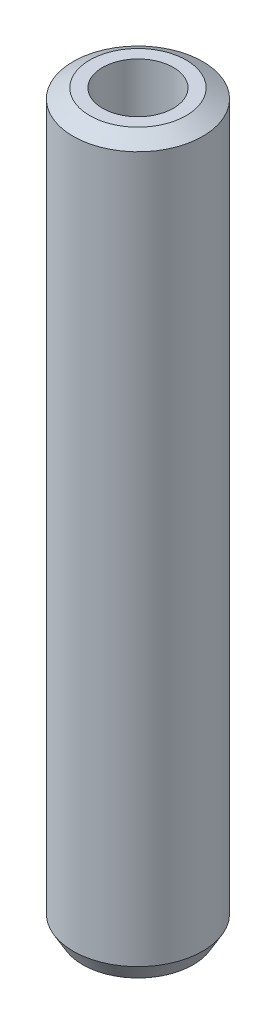
ISO-10303-21;
HEADER;
FILE_DESCRIPTION(('STEP AP214'),'2;1');
FILE_NAME('part.step','',(''),(''),'','','');
FILE_SCHEMA(('AUTOMOTIVE_DESIGN { 1 0 10303 214 1 1 1 1 }'));
ENDSEC;
DATA;
#1=APPLICATION_CONTEXT('core data for automotive mechanical design processes');
#2=APPLICATION_PROTOCOL_DEFINITION('international standard','automotive_design',2000,#1);
#3=PRODUCT_CONTEXT('',#1,'mechanical');
#4=PRODUCT('Part','Part','',(#3));
#5=PRODUCT_RELATED_PRODUCT_CATEGORY('part','',(#4));
#6=PRODUCT_DEFINITION_FORMATION('','',#4);
#7=PRODUCT_DEFINITION_CONTEXT('part definition',#1,'design');
#8=PRODUCT_DEFINITION('design','',#6,#7);
#9=PRODUCT_DEFINITION_SHAPE('','',#8);
#10=(LENGTH_UNIT() NAMED_UNIT(*) SI_UNIT(.MILLI.,.METRE.));
#11=(NAMED_UNIT(*) PLANE_ANGLE_UNIT() SI_UNIT($,.RADIAN.));
#12=(NAMED_UNIT(*) SI_UNIT($,.STERADIAN.) SOLID_ANGLE_UNIT());
#13=UNCERTAINTY_MEASURE_WITH_UNIT(LENGTH_MEASURE(1.E-05),#10,'distance_accuracy_value','');
#14=(GEOMETRIC_REPRESENTATION_CONTEXT(3) GLOBAL_UNCERTAINTY_ASSIGNED_CONTEXT((#13)) GLOBAL_UNIT_ASSIGNED_CONTEXT((#10,
#11,#12)) REPRESENTATION_CONTEXT('',''));
#15=CARTESIAN_POINT('',(0.,0.,0.));
#16=DIRECTION('',(0.,0.,1.));
#17=DIRECTION('',(1.,0.,0.));
#18=AXIS2_PLACEMENT_3D('',#15,#16,#17);
#19=CARTESIAN_POINT('',(0.,254.082430996546,0.));
#20=DIRECTION('',(0.,-1.,0.));
#21=DIRECTION('',(0.,0.,-1.));
#22=AXIS2_PLACEMENT_3D('',#19,#20,#21);
#23=CYLINDRICAL_SURFACE('',#22,22.5);
#24=CARTESIAN_POINT('',(0.,250.754810845848,0.));
#25=DIRECTION('',(0.,1.,0.));
#26=DIRECTION('',(0.,0.,1.));
#27=AXIS2_PLACEMENT_3D('',#24,#25,#26);
#28=CIRCLE('',#27,22.5);
#29=CARTESIAN_POINT('',(0.,250.754810845848,22.5));
#30=VERTEX_POINT('',#29);
#31=EDGE_CURVE('E50',#30,#30,#28,.F.);
#32=ORIENTED_EDGE('',*,*,#31,.T.);
#33=EDGE_LOOP('',(#32));
#34=FACE_BOUND('',#33,.T.);
#35=CARTESIAN_POINT('',(0.,5.76360716929813,0.));
#36=DIRECTION('',(0.,1.,0.));
#37=DIRECTION('',(0.,0.,1.));
#38=AXIS2_PLACEMENT_3D('',#35,#36,#37);
#39=CIRCLE('',#38,22.5);
#40=CARTESIAN_POINT('',(0.,5.76360716929813,22.5));
#41=VERTEX_POINT('',#40);
#42=EDGE_CURVE('E51',#41,#41,#39,.T.);
#43=ORIENTED_EDGE('',*,*,#42,.T.);
#44=EDGE_LOOP('',(#43));
#45=FACE_BOUND('',#44,.T.);
#46=ADVANCED_FACE('F39',(#34,#45),#23,.T.);
#47=CARTESIAN_POINT('',(0.,254.082430996546,0.));
#48=DIRECTION('',(0.,1.,0.));
#49=DIRECTION('',(0.,0.,1.));
#50=AXIS2_PLACEMENT_3D('',#47,#48,#49);
#51=PLANE('',#50);
#52=CARTESIAN_POINT('',(0.,254.082430996546,0.));
#53=DIRECTION('',(0.,1.,0.));
#54=DIRECTION('',(0.,0.,1.));
#55=AXIS2_PLACEMENT_3D('',#52,#53,#54);
#56=CIRCLE('',#55,16.7363928307019);
#57=CARTESIAN_POINT('',(0.,254.082430996546,16.7363928307019));
#58=VERTEX_POINT('',#57);
#59=EDGE_CURVE('E54',#58,#58,#56,.T.);
#60=ORIENTED_EDGE('',*,*,#59,.T.);
#61=EDGE_LOOP('',(#60));
#62=FACE_BOUND('',#61,.T.);
#63=CARTESIAN_POINT('',(0.,254.082430996546,0.));
#64=DIRECTION('',(0.,1.,0.));
#65=DIRECTION('',(0.,0.,1.));
#66=AXIS2_PLACEMENT_3D('',#63,#64,#65);
#67=CIRCLE('',#66,12.2979417798204);
#68=CARTESIAN_POINT('',(0.,254.082430996546,12.2979417798204));
#69=VERTEX_POINT('',#68);
#70=EDGE_CURVE('E58',#69,#69,#67,.T.);
#71=ORIENTED_EDGE('',*,*,#70,.F.);
#72=EDGE_LOOP('',(#71));
#73=FACE_BOUND('',#72,.T.);
#74=ADVANCED_FACE('F69',(#62,#73),#51,.T.);
#75=CARTESIAN_POINT('',(0.,0.,0.));
#76=DIRECTION('',(0.,1.,0.));
#77=DIRECTION('',(0.,0.,1.));
#78=AXIS2_PLACEMENT_3D('',#75,#76,#77);
#79=PLANE('',#78);
#80=CARTESIAN_POINT('',(0.,0.,0.));
#81=DIRECTION('',(0.,1.,0.));
#82=DIRECTION('',(0.,0.,1.));
#83=AXIS2_PLACEMENT_3D('',#80,#81,#82);
#84=CIRCLE('',#83,19.1723798493024);
#85=CARTESIAN_POINT('',(0.,0.,19.1723798493024));
#86=VERTEX_POINT('',#85);
#87=EDGE_CURVE('E10',#86,#86,#84,.F.);
#88=ORIENTED_EDGE('',*,*,#87,.T.);
#89=EDGE_LOOP('',(#88));
#90=FACE_BOUND('',#89,.T.);
#91=CARTESIAN_POINT('',(0.,0.,0.));
#92=DIRECTION('',(0.,1.,0.));
#93=DIRECTION('',(0.,0.,1.));
#94=AXIS2_PLACEMENT_3D('',#91,#92,#93);
#95=CIRCLE('',#94,12.2979417798204);
#96=CARTESIAN_POINT('',(0.,0.,12.2979417798204));
#97=VERTEX_POINT('',#96);
#98=EDGE_CURVE('E63',#97,#97,#95,.T.);
#99=ORIENTED_EDGE('',*,*,#98,.T.);
#100=EDGE_LOOP('',(#99));
#101=FACE_BOUND('',#100,.T.);
#102=ADVANCED_FACE('F75',(#90,#101),#79,.F.);
#103=CARTESIAN_POINT('',(0.,254.082430996546,0.));
#104=DIRECTION('',(0.,-1.,0.));
#105=DIRECTION('',(0.,0.,-1.));
#106=AXIS2_PLACEMENT_3D('',#103,#104,#105);
#107=CYLINDRICAL_SURFACE('',#106,12.2979417798204);
#108=ORIENTED_EDGE('',*,*,#70,.T.);
#109=EDGE_LOOP('',(#108));
#110=FACE_BOUND('',#109,.T.);
#111=ORIENTED_EDGE('',*,*,#98,.F.);
#112=EDGE_LOOP('',(#111));
#113=FACE_BOUND('',#112,.T.);
#114=ADVANCED_FACE('F70',(#110,#113),#107,.F.);
#115=CARTESIAN_POINT('',(0.,254.082430996546,0.));
#116=DIRECTION('',(0.,-1.,0.));
#117=DIRECTION('',(0.,0.,-1.));
#118=AXIS2_PLACEMENT_3D('',#115,#116,#117);
#119=CONICAL_SURFACE('',#118,16.7363928307019,1.04719755119659);
#120=ORIENTED_EDGE('',*,*,#31,.F.);
#121=EDGE_LOOP('',(#120));
#122=FACE_BOUND('',#121,.T.);
#123=ORIENTED_EDGE('',*,*,#59,.F.);
#124=EDGE_LOOP('',(#123));
#125=FACE_BOUND('',#124,.T.);
#126=ADVANCED_FACE('F81',(#122,#125),#119,.T.);
#127=CARTESIAN_POINT('',(0.,5.76360716929813,0.));
#128=DIRECTION('',(0.,1.,0.));
#129=DIRECTION('',(0.,0.,1.));
#130=AXIS2_PLACEMENT_3D('',#127,#128,#129);
#131=CONICAL_SURFACE('',#130,22.5,0.523598775598305);
#132=ORIENTED_EDGE('',*,*,#87,.F.);
#133=EDGE_LOOP('',(#132));
#134=FACE_BOUND('',#133,.T.);
#135=ORIENTED_EDGE('',*,*,#42,.F.);
#136=EDGE_LOOP('',(#135));
#137=FACE_BOUND('',#136,.T.);
#138=ADVANCED_FACE('F45',(#134,#137),#131,.T.);
#139=CLOSED_SHELL('',(#46,#74,#102,#114,#126,#138));
#140=MANIFOLD_SOLID_BREP('B2',#139);
#141=ADVANCED_BREP_SHAPE_REPRESENTATION('',(#18,#140),#14);
#142=SHAPE_DEFINITION_REPRESENTATION(#9,#141);
ENDSEC;
END-ISO-10303-21;
